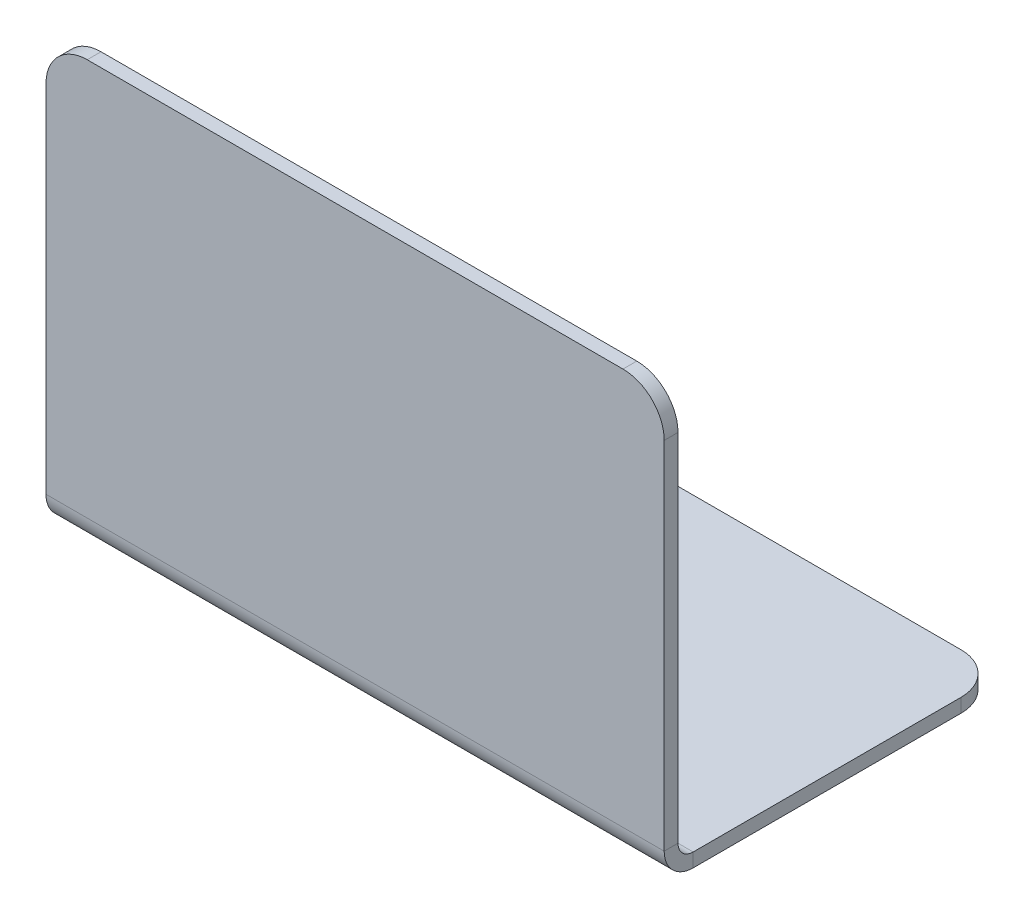
ISO-10303-21;
HEADER;
FILE_DESCRIPTION(('STEP AP214'),'2;1');
FILE_NAME('part.step','',(''),(''),'','','');
FILE_SCHEMA(('AUTOMOTIVE_DESIGN { 1 0 10303 214 1 1 1 1 }'));
ENDSEC;
DATA;
#1=APPLICATION_CONTEXT('core data for automotive mechanical design processes');
#2=APPLICATION_PROTOCOL_DEFINITION('international standard','automotive_design',2000,#1);
#3=PRODUCT_CONTEXT('',#1,'mechanical');
#4=PRODUCT('Part','Part','',(#3));
#5=PRODUCT_RELATED_PRODUCT_CATEGORY('part','',(#4));
#6=PRODUCT_DEFINITION_FORMATION('','',#4);
#7=PRODUCT_DEFINITION_CONTEXT('part definition',#1,'design');
#8=PRODUCT_DEFINITION('design','',#6,#7);
#9=PRODUCT_DEFINITION_SHAPE('','',#8);
#10=(LENGTH_UNIT() NAMED_UNIT(*) SI_UNIT(.MILLI.,.METRE.));
#11=(NAMED_UNIT(*) PLANE_ANGLE_UNIT() SI_UNIT($,.RADIAN.));
#12=(NAMED_UNIT(*) SI_UNIT($,.STERADIAN.) SOLID_ANGLE_UNIT());
#13=UNCERTAINTY_MEASURE_WITH_UNIT(LENGTH_MEASURE(1.E-05),#10,'distance_accuracy_value','');
#14=(GEOMETRIC_REPRESENTATION_CONTEXT(3) GLOBAL_UNCERTAINTY_ASSIGNED_CONTEXT((#13)) GLOBAL_UNIT_ASSIGNED_CONTEXT((#10,
#11,#12)) REPRESENTATION_CONTEXT('',''));
#15=CARTESIAN_POINT('',(0.,0.,0.));
#16=DIRECTION('',(0.,0.,1.));
#17=DIRECTION('',(1.,0.,0.));
#18=AXIS2_PLACEMENT_3D('',#15,#16,#17);
#19=CARTESIAN_POINT('',(0.,-0.67,0.));
#20=DIRECTION('',(-1.,0.,0.));
#21=DIRECTION('',(0.,0.,1.));
#22=AXIS2_PLACEMENT_3D('',#19,#20,#21);
#23=PLANE('',#22);
#24=DIRECTION('',(0.,0.,1.));
#25=VECTOR('',#24,1.);
#26=CARTESIAN_POINT('',(0.,0.,0.));
#27=LINE('',#26,#25);
#28=CARTESIAN_POINT('',(0.,0.,2.));
#29=VERTEX_POINT('',#28);
#30=CARTESIAN_POINT('',(0.,0.,15.));
#31=VERTEX_POINT('',#30);
#32=EDGE_CURVE('E196',#29,#31,#27,.T.);
#33=ORIENTED_EDGE('',*,*,#32,.F.);
#34=DIRECTION('',(0.,1.,0.));
#35=VECTOR('',#34,1.);
#36=CARTESIAN_POINT('',(0.,-0.67,2.));
#37=LINE('',#36,#35);
#38=CARTESIAN_POINT('',(0.,-0.67,2.));
#39=VERTEX_POINT('',#38);
#40=EDGE_CURVE('E234',#29,#39,#37,.F.);
#41=ORIENTED_EDGE('',*,*,#40,.T.);
#42=DIRECTION('',(0.,0.,1.));
#43=VECTOR('',#42,1.);
#44=CARTESIAN_POINT('',(0.,-0.67,0.));
#45=LINE('',#44,#43);
#46=CARTESIAN_POINT('',(0.,-0.67,15.));
#47=VERTEX_POINT('',#46);
#48=EDGE_CURVE('E201',#39,#47,#45,.T.);
#49=ORIENTED_EDGE('',*,*,#48,.T.);
#50=DIRECTION('',(0.,1.,0.));
#51=VECTOR('',#50,1.);
#52=CARTESIAN_POINT('',(0.,-0.67,15.));
#53=LINE('',#52,#51);
#54=EDGE_CURVE('E211',#47,#31,#53,.T.);
#55=ORIENTED_EDGE('',*,*,#54,.T.);
#56=EDGE_LOOP('',(#33,#41,#49,#55));
#57=FACE_BOUND('',#56,.T.);
#58=ADVANCED_FACE('F56',(#57),#23,.T.);
#59=CARTESIAN_POINT('',(0.,-0.67,0.));
#60=DIRECTION('',(0.,0.,-1.));
#61=DIRECTION('',(-1.,0.,0.));
#62=AXIS2_PLACEMENT_3D('',#59,#60,#61);
#63=PLANE('',#62);
#64=DIRECTION('',(-1.,0.,0.));
#65=VECTOR('',#64,1.);
#66=CARTESIAN_POINT('',(0.,-0.67,0.));
#67=LINE('',#66,#65);
#68=CARTESIAN_POINT('',(28.,-0.67,0.));
#69=VERTEX_POINT('',#68);
#70=CARTESIAN_POINT('',(2.,-0.67,0.));
#71=VERTEX_POINT('',#70);
#72=EDGE_CURVE('E208',#69,#71,#67,.T.);
#73=ORIENTED_EDGE('',*,*,#72,.T.);
#74=DIRECTION('',(0.,1.,0.));
#75=VECTOR('',#74,1.);
#76=CARTESIAN_POINT('',(2.,-0.67,0.));
#77=LINE('',#76,#75);
#78=CARTESIAN_POINT('',(2.,0.,0.));
#79=VERTEX_POINT('',#78);
#80=EDGE_CURVE('E227',#71,#79,#77,.T.);
#81=ORIENTED_EDGE('',*,*,#80,.T.);
#82=DIRECTION('',(-1.,0.,0.));
#83=VECTOR('',#82,1.);
#84=CARTESIAN_POINT('',(0.,0.,0.));
#85=LINE('',#84,#83);
#86=CARTESIAN_POINT('',(28.,0.,0.));
#87=VERTEX_POINT('',#86);
#88=EDGE_CURVE('E203',#87,#79,#85,.T.);
#89=ORIENTED_EDGE('',*,*,#88,.F.);
#90=DIRECTION('',(0.,1.,0.));
#91=VECTOR('',#90,1.);
#92=CARTESIAN_POINT('',(28.,-0.67,0.));
#93=LINE('',#92,#91);
#94=EDGE_CURVE('E223',#87,#69,#93,.F.);
#95=ORIENTED_EDGE('',*,*,#94,.T.);
#96=EDGE_LOOP('',(#73,#81,#89,#95));
#97=FACE_BOUND('',#96,.T.);
#98=ADVANCED_FACE('F297',(#97),#63,.T.);
#99=CARTESIAN_POINT('',(30.,-0.67,0.));
#100=DIRECTION('',(1.,0.,0.));
#101=DIRECTION('',(0.,0.,-1.));
#102=AXIS2_PLACEMENT_3D('',#99,#100,#101);
#103=PLANE('',#102);
#104=DIRECTION('',(0.,0.,-1.));
#105=VECTOR('',#104,1.);
#106=CARTESIAN_POINT('',(30.,-0.67,0.));
#107=LINE('',#106,#105);
#108=CARTESIAN_POINT('',(30.,-0.67,15.));
#109=VERTEX_POINT('',#108);
#110=CARTESIAN_POINT('',(30.,-0.67,2.));
#111=VERTEX_POINT('',#110);
#112=EDGE_CURVE('E205',#109,#111,#107,.T.);
#113=ORIENTED_EDGE('',*,*,#112,.T.);
#114=DIRECTION('',(0.,1.,0.));
#115=VECTOR('',#114,1.);
#116=CARTESIAN_POINT('',(30.,-0.67,2.));
#117=LINE('',#116,#115);
#118=CARTESIAN_POINT('',(30.,0.,2.));
#119=VERTEX_POINT('',#118);
#120=EDGE_CURVE('E240',#111,#119,#117,.T.);
#121=ORIENTED_EDGE('',*,*,#120,.T.);
#122=DIRECTION('',(0.,0.,-1.));
#123=VECTOR('',#122,1.);
#124=CARTESIAN_POINT('',(30.,0.,0.));
#125=LINE('',#124,#123);
#126=CARTESIAN_POINT('',(30.,0.,15.));
#127=VERTEX_POINT('',#126);
#128=EDGE_CURVE('E216',#127,#119,#125,.T.);
#129=ORIENTED_EDGE('',*,*,#128,.F.);
#130=DIRECTION('',(0.,1.,0.));
#131=VECTOR('',#130,1.);
#132=CARTESIAN_POINT('',(30.,-0.67,15.));
#133=LINE('',#132,#131);
#134=EDGE_CURVE('E221',#109,#127,#133,.T.);
#135=ORIENTED_EDGE('',*,*,#134,.F.);
#136=EDGE_LOOP('',(#113,#121,#129,#135));
#137=FACE_BOUND('',#136,.T.);
#138=ADVANCED_FACE('F289',(#137),#103,.T.);
#139=CARTESIAN_POINT('',(0.,-0.67,0.));
#140=DIRECTION('',(0.,1.,0.));
#141=DIRECTION('',(0.,0.,1.));
#142=AXIS2_PLACEMENT_3D('',#139,#140,#141);
#143=PLANE('',#142);
#144=CARTESIAN_POINT('',(15.,-0.67,7.9066));
#145=DIRECTION('',(0.,1.,0.));
#146=DIRECTION('',(0.,0.,1.));
#147=AXIS2_PLACEMENT_3D('',#144,#145,#146);
#148=CIRCLE('',#147,1.7);
#149=CARTESIAN_POINT('',(15.,-0.67,9.60659999999999));
#150=VERTEX_POINT('',#149);
#151=EDGE_CURVE('E195',#150,#150,#148,.T.);
#152=ORIENTED_EDGE('',*,*,#151,.T.);
#153=EDGE_LOOP('',(#152));
#154=FACE_BOUND('',#153,.T.);
#155=ORIENTED_EDGE('',*,*,#48,.F.);
#156=CARTESIAN_POINT('',(2.,-0.67,2.));
#157=DIRECTION('',(0.,1.,0.));
#158=DIRECTION('',(0.,0.,1.));
#159=AXIS2_PLACEMENT_3D('',#156,#157,#158);
#160=CIRCLE('',#159,2.);
#161=EDGE_CURVE('E238',#39,#71,#160,.F.);
#162=ORIENTED_EDGE('',*,*,#161,.T.);
#163=ORIENTED_EDGE('',*,*,#72,.F.);
#164=CARTESIAN_POINT('',(28.,-0.67,2.));
#165=DIRECTION('',(0.,1.,0.));
#166=DIRECTION('',(0.,0.,1.));
#167=AXIS2_PLACEMENT_3D('',#164,#165,#166);
#168=CIRCLE('',#167,2.);
#169=EDGE_CURVE('E236',#69,#111,#168,.F.);
#170=ORIENTED_EDGE('',*,*,#169,.T.);
#171=ORIENTED_EDGE('',*,*,#112,.F.);
#172=DIRECTION('',(1.,0.,0.));
#173=VECTOR('',#172,1.);
#174=CARTESIAN_POINT('',(0.,-0.67,15.));
#175=LINE('',#174,#173);
#176=EDGE_CURVE('E156',#47,#109,#175,.T.);
#177=ORIENTED_EDGE('',*,*,#176,.F.);
#178=EDGE_LOOP('',(#155,#162,#163,#170,#171,#177));
#179=FACE_BOUND('',#178,.T.);
#180=ADVANCED_FACE('F283',(#154,#179),#143,.F.);
#181=CARTESIAN_POINT('',(0.,0.,0.));
#182=DIRECTION('',(0.,1.,0.));
#183=DIRECTION('',(0.,0.,1.));
#184=AXIS2_PLACEMENT_3D('',#181,#182,#183);
#185=PLANE('',#184);
#186=CARTESIAN_POINT('',(15.,0.,7.9066));
#187=DIRECTION('',(0.,1.,0.));
#188=DIRECTION('',(0.,0.,1.));
#189=AXIS2_PLACEMENT_3D('',#186,#187,#188);
#190=CIRCLE('',#189,1.7);
#191=CARTESIAN_POINT('',(15.,0.,9.60659999999999));
#192=VERTEX_POINT('',#191);
#193=EDGE_CURVE('E349',#192,#192,#190,.T.);
#194=ORIENTED_EDGE('',*,*,#193,.F.);
#195=EDGE_LOOP('',(#194));
#196=FACE_BOUND('',#195,.T.);
#197=ORIENTED_EDGE('',*,*,#88,.T.);
#198=CARTESIAN_POINT('',(2.,0.,2.));
#199=DIRECTION('',(0.,1.,0.));
#200=DIRECTION('',(0.,0.,1.));
#201=AXIS2_PLACEMENT_3D('',#198,#199,#200);
#202=CIRCLE('',#201,2.);
#203=EDGE_CURVE('E232',#79,#29,#202,.T.);
#204=ORIENTED_EDGE('',*,*,#203,.T.);
#205=ORIENTED_EDGE('',*,*,#32,.T.);
#206=DIRECTION('',(1.,0.,0.));
#207=VECTOR('',#206,1.);
#208=CARTESIAN_POINT('',(0.,0.,15.));
#209=LINE('',#208,#207);
#210=EDGE_CURVE('E213',#31,#127,#209,.T.);
#211=ORIENTED_EDGE('',*,*,#210,.T.);
#212=ORIENTED_EDGE('',*,*,#128,.T.);
#213=CARTESIAN_POINT('',(28.,0.,2.));
#214=DIRECTION('',(0.,1.,0.));
#215=DIRECTION('',(0.,0.,1.));
#216=AXIS2_PLACEMENT_3D('',#213,#214,#215);
#217=CIRCLE('',#216,2.);
#218=EDGE_CURVE('E230',#119,#87,#217,.T.);
#219=ORIENTED_EDGE('',*,*,#218,.T.);
#220=EDGE_LOOP('',(#197,#204,#205,#211,#212,#219));
#221=FACE_BOUND('',#220,.T.);
#222=ADVANCED_FACE('F291',(#196,#221),#185,.T.);
#223=CARTESIAN_POINT('',(0.,0.736599999999997,15.));
#224=DIRECTION('',(-1.,0.,0.));
#225=DIRECTION('',(0.,0.,1.));
#226=AXIS2_PLACEMENT_3D('',#223,#224,#225);
#227=PLANE('',#226);
#228=DIRECTION('',(0.,0.,-1.));
#229=VECTOR('',#228,1.);
#230=CARTESIAN_POINT('',(0.,0.736599999999997,16.4066));
#231=LINE('',#230,#229);
#232=CARTESIAN_POINT('',(0.,0.736599999999997,15.7366));
#233=VERTEX_POINT('',#232);
#234=CARTESIAN_POINT('',(0.,0.736599999999997,16.4066));
#235=VERTEX_POINT('',#234);
#236=EDGE_CURVE('E192',#233,#235,#231,.F.);
#237=ORIENTED_EDGE('',*,*,#236,.F.);
#238=CARTESIAN_POINT('',(0.,0.736599999999997,15.));
#239=DIRECTION('',(1.,0.,0.));
#240=DIRECTION('',(0.,0.,-1.));
#241=AXIS2_PLACEMENT_3D('',#238,#239,#240);
#242=CIRCLE('',#241,0.736599999999997);
#243=EDGE_CURVE('E160',#31,#233,#242,.F.);
#244=ORIENTED_EDGE('',*,*,#243,.F.);
#245=ORIENTED_EDGE('',*,*,#54,.F.);
#246=CARTESIAN_POINT('',(0.,0.736599999999997,15.));
#247=DIRECTION('',(1.,0.,0.));
#248=DIRECTION('',(0.,0.,-1.));
#249=AXIS2_PLACEMENT_3D('',#246,#247,#248);
#250=CIRCLE('',#249,1.4066);
#251=EDGE_CURVE('E159',#47,#235,#250,.F.);
#252=ORIENTED_EDGE('',*,*,#251,.T.);
#253=EDGE_LOOP('',(#237,#244,#245,#252));
#254=FACE_BOUND('',#253,.T.);
#255=ADVANCED_FACE('F276',(#254),#227,.T.);
#256=CARTESIAN_POINT('',(30.,0.736599999999997,15.));
#257=DIRECTION('',(-1.,0.,0.));
#258=DIRECTION('',(0.,0.,1.));
#259=AXIS2_PLACEMENT_3D('',#256,#257,#258);
#260=PLANE('',#259);
#261=CARTESIAN_POINT('',(30.,0.736599999999997,15.));
#262=DIRECTION('',(1.,0.,0.));
#263=DIRECTION('',(0.,0.,-1.));
#264=AXIS2_PLACEMENT_3D('',#261,#262,#263);
#265=CIRCLE('',#264,0.736599999999997);
#266=CARTESIAN_POINT('',(30.,0.736599999999997,15.7366));
#267=VERTEX_POINT('',#266);
#268=EDGE_CURVE('E167',#267,#127,#265,.T.);
#269=ORIENTED_EDGE('',*,*,#268,.F.);
#270=DIRECTION('',(0.,0.,-1.));
#271=VECTOR('',#270,1.);
#272=CARTESIAN_POINT('',(30.,0.736599999999997,15.7366));
#273=LINE('',#272,#271);
#274=CARTESIAN_POINT('',(30.,0.736599999999997,16.4066));
#275=VERTEX_POINT('',#274);
#276=EDGE_CURVE('E164',#267,#275,#273,.F.);
#277=ORIENTED_EDGE('',*,*,#276,.T.);
#278=CARTESIAN_POINT('',(30.,0.736599999999997,15.));
#279=DIRECTION('',(1.,0.,0.));
#280=DIRECTION('',(0.,0.,-1.));
#281=AXIS2_PLACEMENT_3D('',#278,#279,#280);
#282=CIRCLE('',#281,1.4066);
#283=EDGE_CURVE('E148',#275,#109,#282,.T.);
#284=ORIENTED_EDGE('',*,*,#283,.T.);
#285=ORIENTED_EDGE('',*,*,#134,.T.);
#286=EDGE_LOOP('',(#269,#277,#284,#285));
#287=FACE_BOUND('',#286,.T.);
#288=ADVANCED_FACE('F165',(#287),#260,.F.);
#289=CARTESIAN_POINT('',(30.,0.736599999999997,15.));
#290=DIRECTION('',(1.,0.,0.));
#291=DIRECTION('',(0.,0.,1.));
#292=AXIS2_PLACEMENT_3D('',#289,#290,#291);
#293=CYLINDRICAL_SURFACE('',#292,1.4066);
#294=ORIENTED_EDGE('',*,*,#176,.T.);
#295=ORIENTED_EDGE('',*,*,#283,.F.);
#296=DIRECTION('',(1.,0.,0.));
#297=VECTOR('',#296,1.);
#298=CARTESIAN_POINT('',(0.,0.736599999999997,16.4066));
#299=LINE('',#298,#297);
#300=EDGE_CURVE('E153',#275,#235,#299,.F.);
#301=ORIENTED_EDGE('',*,*,#300,.T.);
#302=ORIENTED_EDGE('',*,*,#251,.F.);
#303=EDGE_LOOP('',(#294,#295,#301,#302));
#304=FACE_BOUND('',#303,.T.);
#305=ADVANCED_FACE('F150',(#304),#293,.T.);
#306=CARTESIAN_POINT('',(30.,0.736599999999997,15.));
#307=DIRECTION('',(1.,0.,0.));
#308=DIRECTION('',(0.,0.,1.));
#309=AXIS2_PLACEMENT_3D('',#306,#307,#308);
#310=CYLINDRICAL_SURFACE('',#309,0.736599999999997);
#311=ORIENTED_EDGE('',*,*,#210,.F.);
#312=ORIENTED_EDGE('',*,*,#243,.T.);
#313=DIRECTION('',(1.,0.,0.));
#314=VECTOR('',#313,1.);
#315=CARTESIAN_POINT('',(0.,0.736599999999997,15.7366));
#316=LINE('',#315,#314);
#317=EDGE_CURVE('E169',#233,#267,#316,.T.);
#318=ORIENTED_EDGE('',*,*,#317,.T.);
#319=ORIENTED_EDGE('',*,*,#268,.T.);
#320=EDGE_LOOP('',(#311,#312,#318,#319));
#321=FACE_BOUND('',#320,.T.);
#322=ADVANCED_FACE('F272',(#321),#310,.F.);
#323=CARTESIAN_POINT('',(0.,0.,16.4066));
#324=DIRECTION('',(1.,0.,0.));
#325=DIRECTION('',(0.,1.,0.));
#326=AXIS2_PLACEMENT_3D('',#323,#324,#325);
#327=PLANE('',#326);
#328=DIRECTION('',(0.,-1.,0.));
#329=VECTOR('',#328,1.);
#330=CARTESIAN_POINT('',(0.,0.,16.4066));
#331=LINE('',#330,#329);
#332=CARTESIAN_POINT('',(0.,18.,16.4066));
#333=VERTEX_POINT('',#332);
#334=EDGE_CURVE('E176',#333,#235,#331,.T.);
#335=ORIENTED_EDGE('',*,*,#334,.F.);
#336=DIRECTION('',(0.,0.,-1.));
#337=VECTOR('',#336,1.);
#338=CARTESIAN_POINT('',(0.,18.,16.4066));
#339=LINE('',#338,#337);
#340=CARTESIAN_POINT('',(0.,18.,15.7366));
#341=VERTEX_POINT('',#340);
#342=EDGE_CURVE('E243',#333,#341,#339,.T.);
#343=ORIENTED_EDGE('',*,*,#342,.T.);
#344=DIRECTION('',(0.,1.,0.));
#345=VECTOR('',#344,1.);
#346=CARTESIAN_POINT('',(0.,0.,15.7366));
#347=LINE('',#346,#345);
#348=EDGE_CURVE('E177',#341,#233,#347,.F.);
#349=ORIENTED_EDGE('',*,*,#348,.T.);
#350=ORIENTED_EDGE('',*,*,#236,.T.);
#351=EDGE_LOOP('',(#335,#343,#349,#350));
#352=FACE_BOUND('',#351,.T.);
#353=ADVANCED_FACE('F259',(#352),#327,.F.);
#354=CARTESIAN_POINT('',(30.,20.,16.4066));
#355=DIRECTION('',(-1.,0.,0.));
#356=DIRECTION('',(0.,-1.,0.));
#357=AXIS2_PLACEMENT_3D('',#354,#355,#356);
#358=PLANE('',#357);
#359=DIRECTION('',(0.,-1.,0.));
#360=VECTOR('',#359,1.);
#361=CARTESIAN_POINT('',(30.,20.,15.7366));
#362=LINE('',#361,#360);
#363=CARTESIAN_POINT('',(30.,18.,15.7366));
#364=VERTEX_POINT('',#363);
#365=EDGE_CURVE('E188',#267,#364,#362,.F.);
#366=ORIENTED_EDGE('',*,*,#365,.T.);
#367=DIRECTION('',(0.,0.,-1.));
#368=VECTOR('',#367,1.);
#369=CARTESIAN_POINT('',(30.,18.,16.4066));
#370=LINE('',#369,#368);
#371=CARTESIAN_POINT('',(30.,18.,16.4066));
#372=VERTEX_POINT('',#371);
#373=EDGE_CURVE('E13',#364,#372,#370,.F.);
#374=ORIENTED_EDGE('',*,*,#373,.T.);
#375=DIRECTION('',(0.,1.,0.));
#376=VECTOR('',#375,1.);
#377=CARTESIAN_POINT('',(30.,0.,16.4066));
#378=LINE('',#377,#376);
#379=EDGE_CURVE('E173',#275,#372,#378,.T.);
#380=ORIENTED_EDGE('',*,*,#379,.F.);
#381=ORIENTED_EDGE('',*,*,#276,.F.);
#382=EDGE_LOOP('',(#366,#374,#380,#381));
#383=FACE_BOUND('',#382,.T.);
#384=ADVANCED_FACE('F179',(#383),#358,.F.);
#385=CARTESIAN_POINT('',(0.,0.,16.4066));
#386=DIRECTION('',(0.,0.,-1.));
#387=DIRECTION('',(-1.,0.,0.));
#388=AXIS2_PLACEMENT_3D('',#385,#386,#387);
#389=PLANE('',#388);
#390=DIRECTION('',(-1.,0.,0.));
#391=VECTOR('',#390,1.);
#392=CARTESIAN_POINT('',(0.,20.,16.4066));
#393=LINE('',#392,#391);
#394=CARTESIAN_POINT('',(28.,20.,16.4066));
#395=VERTEX_POINT('',#394);
#396=CARTESIAN_POINT('',(2.,20.,16.4066));
#397=VERTEX_POINT('',#396);
#398=EDGE_CURVE('E180',#395,#397,#393,.T.);
#399=ORIENTED_EDGE('',*,*,#398,.T.);
#400=CARTESIAN_POINT('',(2.,18.,16.4066));
#401=DIRECTION('',(0.,0.,-1.));
#402=DIRECTION('',(-1.,0.,0.));
#403=AXIS2_PLACEMENT_3D('',#400,#401,#402);
#404=CIRCLE('',#403,2.);
#405=EDGE_CURVE('E64',#397,#333,#404,.F.);
#406=ORIENTED_EDGE('',*,*,#405,.T.);
#407=ORIENTED_EDGE('',*,*,#334,.T.);
#408=ORIENTED_EDGE('',*,*,#300,.F.);
#409=ORIENTED_EDGE('',*,*,#379,.T.);
#410=CARTESIAN_POINT('',(28.,18.,16.4066));
#411=DIRECTION('',(0.,0.,-1.));
#412=DIRECTION('',(-1.,0.,0.));
#413=AXIS2_PLACEMENT_3D('',#410,#411,#412);
#414=CIRCLE('',#413,2.);
#415=EDGE_CURVE('E254',#372,#395,#414,.F.);
#416=ORIENTED_EDGE('',*,*,#415,.T.);
#417=EDGE_LOOP('',(#399,#406,#407,#408,#409,#416));
#418=FACE_BOUND('',#417,.T.);
#419=ADVANCED_FACE('F172',(#418),#389,.F.);
#420=CARTESIAN_POINT('',(0.,0.,15.7366));
#421=DIRECTION('',(0.,0.,-1.));
#422=DIRECTION('',(-1.,0.,0.));
#423=AXIS2_PLACEMENT_3D('',#420,#421,#422);
#424=PLANE('',#423);
#425=ORIENTED_EDGE('',*,*,#348,.F.);
#426=CARTESIAN_POINT('',(2.,18.,15.7366));
#427=DIRECTION('',(0.,0.,-1.));
#428=DIRECTION('',(-1.,0.,0.));
#429=AXIS2_PLACEMENT_3D('',#426,#427,#428);
#430=CIRCLE('',#429,2.);
#431=CARTESIAN_POINT('',(2.,20.,15.7366));
#432=VERTEX_POINT('',#431);
#433=EDGE_CURVE('E248',#341,#432,#430,.T.);
#434=ORIENTED_EDGE('',*,*,#433,.T.);
#435=DIRECTION('',(1.,0.,0.));
#436=VECTOR('',#435,1.);
#437=CARTESIAN_POINT('',(0.,20.,15.7366));
#438=LINE('',#437,#436);
#439=CARTESIAN_POINT('',(28.,20.,15.7366));
#440=VERTEX_POINT('',#439);
#441=EDGE_CURVE('E183',#440,#432,#438,.F.);
#442=ORIENTED_EDGE('',*,*,#441,.F.);
#443=CARTESIAN_POINT('',(28.,18.,15.7366));
#444=DIRECTION('',(0.,0.,-1.));
#445=DIRECTION('',(-1.,0.,0.));
#446=AXIS2_PLACEMENT_3D('',#443,#444,#445);
#447=CIRCLE('',#446,2.);
#448=EDGE_CURVE('E246',#440,#364,#447,.T.);
#449=ORIENTED_EDGE('',*,*,#448,.T.);
#450=ORIENTED_EDGE('',*,*,#365,.F.);
#451=ORIENTED_EDGE('',*,*,#317,.F.);
#452=EDGE_LOOP('',(#425,#434,#442,#449,#450,#451));
#453=FACE_BOUND('',#452,.T.);
#454=ADVANCED_FACE('F265',(#453),#424,.T.);
#455=CARTESIAN_POINT('',(0.,20.,16.4066));
#456=DIRECTION('',(0.,-1.,0.));
#457=DIRECTION('',(0.,0.,-1.));
#458=AXIS2_PLACEMENT_3D('',#455,#456,#457);
#459=PLANE('',#458);
#460=ORIENTED_EDGE('',*,*,#441,.T.);
#461=DIRECTION('',(0.,0.,-1.));
#462=VECTOR('',#461,1.);
#463=CARTESIAN_POINT('',(2.,20.,16.4066));
#464=LINE('',#463,#462);
#465=EDGE_CURVE('E77',#432,#397,#464,.F.);
#466=ORIENTED_EDGE('',*,*,#465,.T.);
#467=ORIENTED_EDGE('',*,*,#398,.F.);
#468=DIRECTION('',(0.,0.,-1.));
#469=VECTOR('',#468,1.);
#470=CARTESIAN_POINT('',(28.,20.,16.4066));
#471=LINE('',#470,#469);
#472=EDGE_CURVE('E250',#395,#440,#471,.T.);
#473=ORIENTED_EDGE('',*,*,#472,.T.);
#474=EDGE_LOOP('',(#460,#466,#467,#473));
#475=FACE_BOUND('',#474,.T.);
#476=ADVANCED_FACE('F267',(#475),#459,.F.);
#477=CARTESIAN_POINT('',(15.,-10.,7.9066));
#478=DIRECTION('',(0.,1.,0.));
#479=DIRECTION('',(0.,0.,1.));
#480=AXIS2_PLACEMENT_3D('',#477,#478,#479);
#481=CYLINDRICAL_SURFACE('',#480,1.7);
#482=ORIENTED_EDGE('',*,*,#193,.T.);
#483=EDGE_LOOP('',(#482));
#484=FACE_BOUND('',#483,.T.);
#485=ORIENTED_EDGE('',*,*,#151,.F.);
#486=EDGE_LOOP('',(#485));
#487=FACE_BOUND('',#486,.T.);
#488=ADVANCED_FACE('F307',(#484,#487),#481,.F.);
#489=CARTESIAN_POINT('',(2.,-0.67,2.));
#490=DIRECTION('',(0.,1.,0.));
#491=DIRECTION('',(0.,0.,1.));
#492=AXIS2_PLACEMENT_3D('',#489,#490,#491);
#493=CYLINDRICAL_SURFACE('',#492,2.);
#494=ORIENTED_EDGE('',*,*,#161,.F.);
#495=ORIENTED_EDGE('',*,*,#40,.F.);
#496=ORIENTED_EDGE('',*,*,#203,.F.);
#497=ORIENTED_EDGE('',*,*,#80,.F.);
#498=EDGE_LOOP('',(#494,#495,#496,#497));
#499=FACE_BOUND('',#498,.T.);
#500=ADVANCED_FACE('F295',(#499),#493,.T.);
#501=CARTESIAN_POINT('',(28.,-0.67,2.));
#502=DIRECTION('',(0.,1.,0.));
#503=DIRECTION('',(0.,0.,1.));
#504=AXIS2_PLACEMENT_3D('',#501,#502,#503);
#505=CYLINDRICAL_SURFACE('',#504,2.);
#506=ORIENTED_EDGE('',*,*,#169,.F.);
#507=ORIENTED_EDGE('',*,*,#94,.F.);
#508=ORIENTED_EDGE('',*,*,#218,.F.);
#509=ORIENTED_EDGE('',*,*,#120,.F.);
#510=EDGE_LOOP('',(#506,#507,#508,#509));
#511=FACE_BOUND('',#510,.T.);
#512=ADVANCED_FACE('F300',(#511),#505,.T.);
#513=CARTESIAN_POINT('',(2.,18.,16.4066));
#514=DIRECTION('',(0.,0.,-1.));
#515=DIRECTION('',(-1.,0.,0.));
#516=AXIS2_PLACEMENT_3D('',#513,#514,#515);
#517=CYLINDRICAL_SURFACE('',#516,2.);
#518=ORIENTED_EDGE('',*,*,#405,.F.);
#519=ORIENTED_EDGE('',*,*,#465,.F.);
#520=ORIENTED_EDGE('',*,*,#433,.F.);
#521=ORIENTED_EDGE('',*,*,#342,.F.);
#522=EDGE_LOOP('',(#518,#519,#520,#521));
#523=FACE_BOUND('',#522,.T.);
#524=ADVANCED_FACE('F262',(#523),#517,.T.);
#525=CARTESIAN_POINT('',(28.,18.,16.4066));
#526=DIRECTION('',(0.,0.,-1.));
#527=DIRECTION('',(-1.,0.,0.));
#528=AXIS2_PLACEMENT_3D('',#525,#526,#527);
#529=CYLINDRICAL_SURFACE('',#528,2.);
#530=ORIENTED_EDGE('',*,*,#415,.F.);
#531=ORIENTED_EDGE('',*,*,#373,.F.);
#532=ORIENTED_EDGE('',*,*,#448,.F.);
#533=ORIENTED_EDGE('',*,*,#472,.F.);
#534=EDGE_LOOP('',(#530,#531,#532,#533));
#535=FACE_BOUND('',#534,.T.);
#536=ADVANCED_FACE('F58',(#535),#529,.T.);
#537=CLOSED_SHELL('',(#58,#98,#138,#180,#222,#255,#288,#305,#322,#353,#384,#419,#454,#476,#488,
#500,#512,#524,#536));
#538=MANIFOLD_SOLID_BREP('B2',#537);
#539=ADVANCED_BREP_SHAPE_REPRESENTATION('',(#18,#538),#14);
#540=SHAPE_DEFINITION_REPRESENTATION(#9,#539);
ENDSEC;
END-ISO-10303-21;
